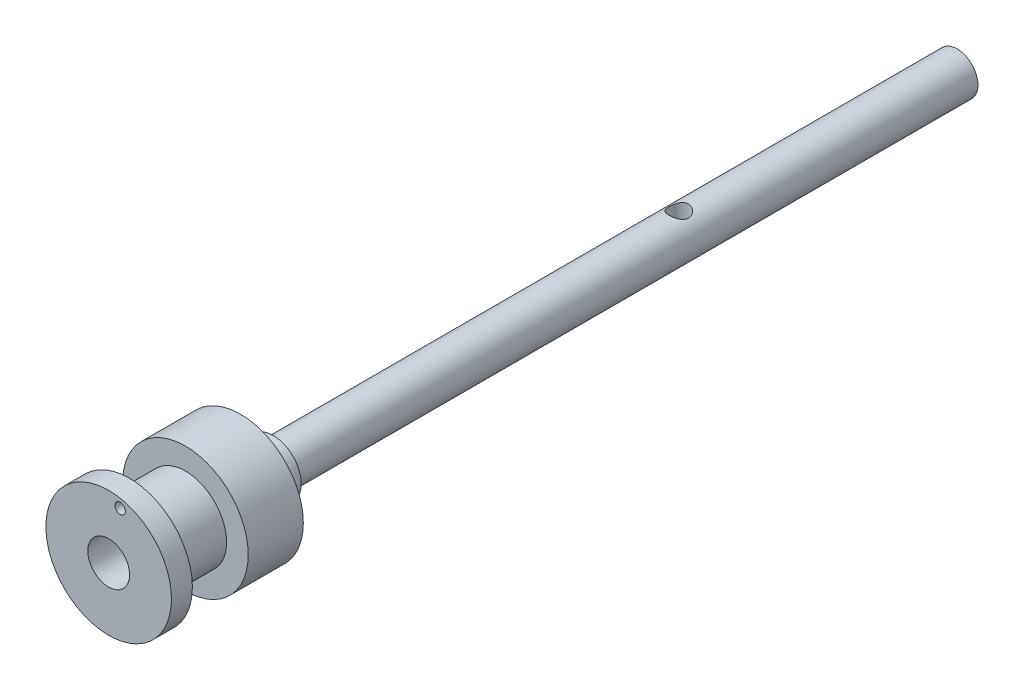
ISO-10303-21;
HEADER;
FILE_DESCRIPTION(('STEP AP214'),'2;1');
FILE_NAME('part.step','',(''),(''),'','','');
FILE_SCHEMA(('AUTOMOTIVE_DESIGN { 1 0 10303 214 1 1 1 1 }'));
ENDSEC;
DATA;
#1=APPLICATION_CONTEXT('core data for automotive mechanical design processes');
#2=APPLICATION_PROTOCOL_DEFINITION('international standard','automotive_design',2000,#1);
#3=PRODUCT_CONTEXT('',#1,'mechanical');
#4=PRODUCT('Part','Part','',(#3));
#5=PRODUCT_RELATED_PRODUCT_CATEGORY('part','',(#4));
#6=PRODUCT_DEFINITION_FORMATION('','',#4);
#7=PRODUCT_DEFINITION_CONTEXT('part definition',#1,'design');
#8=PRODUCT_DEFINITION('design','',#6,#7);
#9=PRODUCT_DEFINITION_SHAPE('','',#8);
#10=(LENGTH_UNIT() NAMED_UNIT(*) SI_UNIT(.MILLI.,.METRE.));
#11=(NAMED_UNIT(*) PLANE_ANGLE_UNIT() SI_UNIT($,.RADIAN.));
#12=(NAMED_UNIT(*) SI_UNIT($,.STERADIAN.) SOLID_ANGLE_UNIT());
#13=UNCERTAINTY_MEASURE_WITH_UNIT(LENGTH_MEASURE(1.E-05),#10,'distance_accuracy_value','');
#14=(GEOMETRIC_REPRESENTATION_CONTEXT(3) GLOBAL_UNCERTAINTY_ASSIGNED_CONTEXT((#13)) GLOBAL_UNIT_ASSIGNED_CONTEXT((#10,
#11,#12)) REPRESENTATION_CONTEXT('',''));
#15=CARTESIAN_POINT('',(0.,0.,0.));
#16=DIRECTION('',(0.,0.,1.));
#17=DIRECTION('',(1.,0.,0.));
#18=AXIS2_PLACEMENT_3D('',#15,#16,#17);
#19=CARTESIAN_POINT('',(0.,0.,98.));
#20=DIRECTION('',(0.,0.,-1.));
#21=DIRECTION('',(-1.,0.,0.));
#22=AXIS2_PLACEMENT_3D('',#19,#20,#21);
#23=CYLINDRICAL_SURFACE('',#22,3.);
#24=CARTESIAN_POINT('',(0.,-2.99999999999999,38.5));
#25=CARTESIAN_POINT('',(0.0741760141958586,-2.99999659855667,38.5000040505541));
#26=CARTESIAN_POINT('',(0.148457438343164,-2.99721866421498,38.5059298208353));
#27=CARTESIAN_POINT('',(0.294860958042646,-2.98638133101227,38.5293877592733));
#28=CARTESIAN_POINT('',(0.366977899485668,-2.97831023303417,38.546945637961));
#29=CARTESIAN_POINT('',(0.506705207958361,-2.95773878056305,38.5928517551339));
#30=CARTESIAN_POINT('',(0.574331184032734,-2.94525483671525,38.6211600432343));
#31=CARTESIAN_POINT('',(0.703790652559765,-2.91703179641225,38.6875743006987));
#32=CARTESIAN_POINT('',(0.765625113804216,-2.90129324579851,38.7256786273952));
#33=CARTESIAN_POINT('',(0.885556018232687,-2.86703510505486,38.8129906836775));
#34=CARTESIAN_POINT('',(0.943262854198603,-2.84841047078529,38.8626918392666));
#35=CARTESIAN_POINT('',(1.04987206669059,-2.81086626705385,38.9707341871541));
#36=CARTESIAN_POINT('',(1.09876864666267,-2.79194651225135,39.0290810220613));
#37=CARTESIAN_POINT('',(1.18954928643586,-2.75454886272565,39.1573436722992));
#38=CARTESIAN_POINT('',(1.23076801131512,-2.73618026181932,39.2277658265075));
#39=CARTESIAN_POINT('',(1.30060459631542,-2.70368671328043,39.3755083341662));
#40=CARTESIAN_POINT('',(1.32923050054669,-2.68955905843085,39.452824245907));
#41=CARTESIAN_POINT('',(1.37136389166293,-2.66831280778357,39.6077086691858));
#42=CARTESIAN_POINT('',(1.38562630954339,-2.66084688805231,39.685022013398));
#43=CARTESIAN_POINT('',(1.40096431780121,-2.65280653141493,39.8412761554687));
#44=CARTESIAN_POINT('',(1.40205018901381,-2.65222672171534,39.9202156363732));
#45=CARTESIAN_POINT('',(1.39156325474428,-2.6577381391041,40.0689521774073));
#46=CARTESIAN_POINT('',(1.381255487101,-2.66316277668237,40.1388686763252));
#47=CARTESIAN_POINT('',(1.35043639237287,-2.67892103840313,40.2758340783928));
#48=CARTESIAN_POINT('',(1.32992244300339,-2.68925592410991,40.3428822397673));
#49=CARTESIAN_POINT('',(1.27887161255287,-2.71390923378543,40.4740721913311));
#50=CARTESIAN_POINT('',(1.24811450695909,-2.7283140240837,40.5381113040015));
#51=CARTESIAN_POINT('',(1.17761205733664,-2.75947702819645,40.6604059963507));
#52=CARTESIAN_POINT('',(1.13786278548149,-2.77623626923161,40.7186590325906));
#53=CARTESIAN_POINT('',(1.04545769592097,-2.81242518177221,40.8343867427587));
#54=CARTESIAN_POINT('',(0.99186913562739,-2.83194722846672,40.8910901886705));
#55=CARTESIAN_POINT('',(0.875809338201009,-2.86996272516678,40.9950011611005));
#56=CARTESIAN_POINT('',(0.813334864133956,-2.88845579691006,41.0422052120085));
#57=CARTESIAN_POINT('',(0.678420066791921,-2.92314231667083,41.1273252580099));
#58=CARTESIAN_POINT('',(0.605704043903019,-2.9392303997136,41.1648505604658));
#59=CARTESIAN_POINT('',(0.454047875045114,-2.9664385628126,41.2268527185111));
#60=CARTESIAN_POINT('',(0.375112098848912,-2.97756209480586,41.2513386428982));
#61=CARTESIAN_POINT('',(0.219630179590069,-2.99289168727817,41.2847753854863));
#62=CARTESIAN_POINT('',(0.143350867486893,-2.99755511855446,41.2947561577534));
#63=CARTESIAN_POINT('',(-0.00993159603062295,-3.00096130674055,41.3020633399195));
#64=CARTESIAN_POINT('',(-0.0869344549310017,-2.99970636153703,41.2993946611306));
#65=CARTESIAN_POINT('',(-0.234138662301144,-2.99169876992405,41.2821402277437));
#66=CARTESIAN_POINT('',(-0.304455247280261,-2.98531143610107,41.268346120726));
#67=CARTESIAN_POINT('',(-0.441661374952197,-2.9681169868393,41.2304147035299));
#68=CARTESIAN_POINT('',(-0.508550515457682,-2.95730935403884,41.2062761826025));
#69=CARTESIAN_POINT('',(-0.63934631057296,-2.93186182190092,41.1476106001117));
#70=CARTESIAN_POINT('',(-0.70309874977937,-2.91711463217098,41.1127878500144));
#71=CARTESIAN_POINT('',(-0.82408133642419,-2.88527461622476,41.034065572947));
#72=CARTESIAN_POINT('',(-0.881308600637795,-2.86818076040266,40.9901620574598));
#73=CARTESIAN_POINT('',(-0.992927203863409,-2.83157928041133,40.8900494219181));
#74=CARTESIAN_POINT('',(-1.04662821994276,-2.81199150907127,40.8330982533047));
#75=CARTESIAN_POINT('',(-1.14397488618524,-2.7738171204936,40.710822052853));
#76=CARTESIAN_POINT('',(-1.18761573536873,-2.7552309844915,40.6454930459361));
#77=CARTESIAN_POINT('',(-1.26487258942864,-2.72065279755534,40.5055462612367));
#78=CARTESIAN_POINT('',(-1.29811762077689,-2.70476441122083,40.4306959670314));
#79=CARTESIAN_POINT('',(-1.35119476914698,-2.67864935946574,40.2754739377038));
#80=CARTESIAN_POINT('',(-1.37104172650418,-2.6684164320798,40.1951084206029));
#81=CARTESIAN_POINT('',(-1.39512361569358,-2.65589863089785,40.0389244522856));
#82=CARTESIAN_POINT('',(-1.40060458275625,-2.65298045006346,39.9633491392689));
#83=CARTESIAN_POINT('',(-1.39928993042138,-2.65367487263324,39.81234617673));
#84=CARTESIAN_POINT('',(-1.39249775922279,-2.65728564169682,39.7369184916911));
#85=CARTESIAN_POINT('',(-1.36795238910771,-2.66999487603889,39.5940999375163));
#86=CARTESIAN_POINT('',(-1.35103435582631,-2.67867409395688,39.5265240407042));
#87=CARTESIAN_POINT('',(-1.30765598987226,-2.70011439829818,39.3952017153972));
#88=CARTESIAN_POINT('',(-1.28119281477062,-2.71287670048705,39.3314564342173));
#89=CARTESIAN_POINT('',(-1.21748406199401,-2.74208602331761,39.2049634549476));
#90=CARTESIAN_POINT('',(-1.17964038065009,-2.7587211195529,39.1425615223786));
#91=CARTESIAN_POINT('',(-1.0949742620724,-2.79340714138716,39.0246101855588));
#92=CARTESIAN_POINT('',(-1.04814763276813,-2.81145872568486,38.9690640006461));
#93=CARTESIAN_POINT('',(-0.941307680520023,-2.84911508911861,38.8606263800043));
#94=CARTESIAN_POINT('',(-0.880442612871025,-2.86869394428718,38.8085607412822));
#95=CARTESIAN_POINT('',(-0.750199086477072,-2.90547332461736,38.7152565671488));
#96=CARTESIAN_POINT('',(-0.680816600685449,-2.92267271652822,38.6740231823952));
#97=CARTESIAN_POINT('',(-0.535611024288782,-2.95272548252542,38.6040125020167));
#98=CARTESIAN_POINT('',(-0.459824309977936,-2.96560157678301,38.5751698583364));
#99=CARTESIAN_POINT('',(-0.303822742627244,-2.98560363061671,38.5309772564507));
#100=CARTESIAN_POINT('',(-0.223621832238211,-2.99274669700571,38.5155871448256));
#101=CARTESIAN_POINT('',(-0.118989792805172,-2.99773444736987,38.5048609854243));
#102=CARTESIAN_POINT('',(-0.0952397688918287,-2.99858232619917,38.5030400999808));
#103=CARTESIAN_POINT('',(-0.0476634596251007,-2.99971565466793,38.50060894435));
#104=CARTESIAN_POINT('',(-0.0238371727597251,-3.00000109308638,38.4999986983156));
#105=CARTESIAN_POINT('',(0.,-2.99999999999999,38.5));
#106=B_SPLINE_CURVE_WITH_KNOTS('',3,(#24,#25,#26,#27,#28,#29,#30,#31,#32,#33,#34,#35,#36,#37,
#38,#39,#40,#41,#42,#43,#44,#45,#46,#47,#48,#49,#50,#51,#52,#53,#54,#55,#56,#57,#58,#59,#60,#61,
#62,#63,#64,#65,#66,#67,#68,#69,#70,#71,#72,#73,#74,#75,#76,#77,#78,#79,#80,#81,#82,#83,#84,#85,
#86,#87,#88,#89,#90,#91,#92,#93,#94,#95,#96,#97,#98,#99,#100,#101,#102,#103,#104,#105),
.UNSPECIFIED.,.T.,.F.,(4,2,2,2,2,2,2,2,2,2,2,2,2,2,2,2,2,2,2,2,2,2,2,2,2,2,2,2,2,2,2,2,2,2,2,2,
2,2,2,2,4),(0.,0.222430614227103,0.445354516020347,0.6674579744595,0.889524213319485,
1.12374008349084,1.35810949364731,1.60776429290694,1.85725938392491,2.0928231469925,
2.32820310256045,2.53985531348055,2.75156193252274,2.96815060600378,3.18483406988204,
3.42504393482462,3.66534152788205,3.91419776760518,4.16288070273415,4.39285884216799,
4.62274769694934,4.83758576938904,5.05244899415581,5.27389671638204,5.49544191175846,
5.73644174754948,5.97755635787824,6.2264897623231,6.47514698203737,6.7013896585824,
6.92756878101077,7.13725924988262,7.34701221368888,7.57065894835864,7.79441030722339,
8.04061569917069,8.28693794895592,8.53194466707523,8.77621756163928,8.84769634435318,
8.91917655309538),.UNSPECIFIED.);
#107=CARTESIAN_POINT('',(0.,-2.99999999999999,38.5));
#108=VERTEX_POINT('',#107);
#109=EDGE_CURVE('E52',#108,#108,#106,.T.);
#110=ORIENTED_EDGE('',*,*,#109,.F.);
#111=EDGE_LOOP('',(#110));
#112=FACE_BOUND('',#111,.T.);
#113=CARTESIAN_POINT('',(0.,0.,98.));
#114=DIRECTION('',(0.,0.,1.));
#115=DIRECTION('',(1.,0.,0.));
#116=AXIS2_PLACEMENT_3D('',#113,#114,#115);
#117=CIRCLE('',#116,3.);
#118=CARTESIAN_POINT('',(3.,0.,98.));
#119=VERTEX_POINT('',#118);
#120=EDGE_CURVE('E10',#119,#119,#117,.T.);
#121=ORIENTED_EDGE('',*,*,#120,.F.);
#122=EDGE_LOOP('',(#121));
#123=FACE_BOUND('',#122,.T.);
#124=CARTESIAN_POINT('',(0.,0.,0.));
#125=DIRECTION('',(0.,0.,1.));
#126=DIRECTION('',(1.,0.,0.));
#127=AXIS2_PLACEMENT_3D('',#124,#125,#126);
#128=CIRCLE('',#127,3.);
#129=CARTESIAN_POINT('',(3.,0.,0.));
#130=VERTEX_POINT('',#129);
#131=EDGE_CURVE('E42',#130,#130,#128,.T.);
#132=ORIENTED_EDGE('',*,*,#131,.T.);
#133=EDGE_LOOP('',(#132));
#134=FACE_BOUND('',#133,.T.);
#135=CARTESIAN_POINT('',(0.,3.00000000000001,38.5));
#136=CARTESIAN_POINT('',(-0.0741760141958469,2.99999659855672,38.5000040505541));
#137=CARTESIAN_POINT('',(-0.148457438343151,2.99721866421499,38.5059298208353));
#138=CARTESIAN_POINT('',(-0.29486095804263,2.98638133101226,38.5293877592733));
#139=CARTESIAN_POINT('',(-0.366977899485652,2.97831023303417,38.546945637961));
#140=CARTESIAN_POINT('',(-0.506705207958344,2.95773878056306,38.5928517551339));
#141=CARTESIAN_POINT('',(-0.574331184032714,2.94525483671525,38.6211600432343));
#142=CARTESIAN_POINT('',(-0.703790652559743,2.91703179641225,38.6875743006987));
#143=CARTESIAN_POINT('',(-0.765625113804195,2.90129324579851,38.7256786273952));
#144=CARTESIAN_POINT('',(-0.885556018232667,2.86703510505487,38.8129906836775));
#145=CARTESIAN_POINT('',(-0.943262854198583,2.8484104707853,38.8626918392666));
#146=CARTESIAN_POINT('',(-1.04987206669057,2.81086626705386,38.9707341871541));
#147=CARTESIAN_POINT('',(-1.09876864666265,2.79194651225135,39.0290810220613));
#148=CARTESIAN_POINT('',(-1.18954928643584,2.75454886272566,39.1573436722992));
#149=CARTESIAN_POINT('',(-1.2307680113151,2.73618026181933,39.2277658265075));
#150=CARTESIAN_POINT('',(-1.30060459631541,2.70368671328044,39.3755083341662));
#151=CARTESIAN_POINT('',(-1.32923050054667,2.68955905843086,39.452824245907));
#152=CARTESIAN_POINT('',(-1.37136389166291,2.66831280778357,39.6077086691858));
#153=CARTESIAN_POINT('',(-1.38562630954337,2.66084688805232,39.6850220133979));
#154=CARTESIAN_POINT('',(-1.4009643178012,2.65280653141493,39.8412761554687));
#155=CARTESIAN_POINT('',(-1.4020501890138,2.65222672171534,39.9202156363732));
#156=CARTESIAN_POINT('',(-1.39156325474427,2.6577381391041,40.0689521774073));
#157=CARTESIAN_POINT('',(-1.38125548710099,2.66316277668237,40.1388686763252));
#158=CARTESIAN_POINT('',(-1.35043639237286,2.67892103840314,40.2758340783928));
#159=CARTESIAN_POINT('',(-1.32992244300339,2.68925592410991,40.3428822397673));
#160=CARTESIAN_POINT('',(-1.27887161255287,2.71390923378543,40.4740721913311));
#161=CARTESIAN_POINT('',(-1.24811450695908,2.7283140240837,40.5381113040015));
#162=CARTESIAN_POINT('',(-1.17761205733663,2.75947702819645,40.6604059963507));
#163=CARTESIAN_POINT('',(-1.13786278548148,2.77623626923161,40.7186590325906));
#164=CARTESIAN_POINT('',(-1.04545769592096,2.81242518177222,40.8343867427587));
#165=CARTESIAN_POINT('',(-0.991869135627378,2.83194722846672,40.8910901886705));
#166=CARTESIAN_POINT('',(-0.875809338200994,2.86996272516678,40.9950011611005));
#167=CARTESIAN_POINT('',(-0.81333486413394,2.88845579691007,41.0422052120085));
#168=CARTESIAN_POINT('',(-0.678420066791903,2.92314231667084,41.1273252580099));
#169=CARTESIAN_POINT('',(-0.605704043903002,2.93923039971361,41.1648505604658));
#170=CARTESIAN_POINT('',(-0.454047875045097,2.9664385628126,41.2268527185111));
#171=CARTESIAN_POINT('',(-0.375112098848896,2.97756209480586,41.2513386428982));
#172=CARTESIAN_POINT('',(-0.219630179590055,2.99289168727817,41.2847753854863));
#173=CARTESIAN_POINT('',(-0.143350867486881,2.99755511855446,41.2947561577534));
#174=CARTESIAN_POINT('',(0.00993159603063199,3.00096130674055,41.3020633399195));
#175=CARTESIAN_POINT('',(0.0869344549310094,2.99970636153703,41.2993946611306));
#176=CARTESIAN_POINT('',(0.234138662301149,2.99169876992405,41.2821402277437));
#177=CARTESIAN_POINT('',(0.304455247280265,2.98531143610107,41.268346120726));
#178=CARTESIAN_POINT('',(0.441661374952199,2.9681169868393,41.2304147035299));
#179=CARTESIAN_POINT('',(0.508550515457684,2.95730935403884,41.2062761826025));
#180=CARTESIAN_POINT('',(0.639346310572959,2.93186182190092,41.1476106001117));
#181=CARTESIAN_POINT('',(0.703098749779367,2.91711463217098,41.1127878500144));
#182=CARTESIAN_POINT('',(0.824081336424185,2.88527461622476,41.034065572947));
#183=CARTESIAN_POINT('',(0.881308600637789,2.86818076040266,40.9901620574598));
#184=CARTESIAN_POINT('',(0.992927203863404,2.83157928041133,40.8900494219181));
#185=CARTESIAN_POINT('',(1.04662821994276,2.81199150907127,40.8330982533047));
#186=CARTESIAN_POINT('',(1.14397488618524,2.7738171204936,40.7108220528531));
#187=CARTESIAN_POINT('',(1.18761573536872,2.7552309844915,40.6454930459362));
#188=CARTESIAN_POINT('',(1.26487258942863,2.72065279755534,40.5055462612367));
#189=CARTESIAN_POINT('',(1.29811762077689,2.70476441122083,40.4306959670314));
#190=CARTESIAN_POINT('',(1.35119476914698,2.67864935946574,40.2754739377038));
#191=CARTESIAN_POINT('',(1.37104172650419,2.6684164320798,40.195108420603));
#192=CARTESIAN_POINT('',(1.39512361569359,2.65589863089785,40.0389244522856));
#193=CARTESIAN_POINT('',(1.40060458275626,2.65298045006346,39.9633491392689));
#194=CARTESIAN_POINT('',(1.39928993042139,2.65367487263323,39.81234617673));
#195=CARTESIAN_POINT('',(1.3924977592228,2.65728564169681,39.7369184916911));
#196=CARTESIAN_POINT('',(1.36795238910772,2.66999487603889,39.5940999375163));
#197=CARTESIAN_POINT('',(1.35103435582632,2.67867409395688,39.5265240407042));
#198=CARTESIAN_POINT('',(1.30765598987227,2.70011439829818,39.3952017153972));
#199=CARTESIAN_POINT('',(1.28119281477063,2.71287670048704,39.3314564342173));
#200=CARTESIAN_POINT('',(1.21748406199402,2.7420860233176,39.2049634549476));
#201=CARTESIAN_POINT('',(1.1796403806501,2.75872111955289,39.1425615223786));
#202=CARTESIAN_POINT('',(1.09497426207241,2.79340714138716,39.0246101855588));
#203=CARTESIAN_POINT('',(1.04814763276814,2.81145872568485,38.9690640006461));
#204=CARTESIAN_POINT('',(0.941307680520035,2.8491150891186,38.8606263800043));
#205=CARTESIAN_POINT('',(0.880442612871037,2.86869394428718,38.8085607412822));
#206=CARTESIAN_POINT('',(0.750199086477081,2.90547332461736,38.7152565671488));
#207=CARTESIAN_POINT('',(0.680816600685458,2.92267271652822,38.6740231823952));
#208=CARTESIAN_POINT('',(0.535611024288789,2.95272548252542,38.6040125020167));
#209=CARTESIAN_POINT('',(0.459824309977943,2.965601576783,38.5751698583364));
#210=CARTESIAN_POINT('',(0.30382274262725,2.98560363061672,38.5309772564507));
#211=CARTESIAN_POINT('',(0.223621832238217,2.99274669700571,38.5155871448256));
#212=CARTESIAN_POINT('',(0.118989792805177,2.99773444736986,38.5048609854243));
#213=CARTESIAN_POINT('',(0.0952397688918338,2.99858232619917,38.5030400999808));
#214=CARTESIAN_POINT('',(0.0476634596251074,2.99971565466794,38.50060894435));
#215=CARTESIAN_POINT('',(0.0238371727597333,3.0000010930864,38.4999986983156));
#216=CARTESIAN_POINT('',(0.,3.00000000000001,38.5));
#217=B_SPLINE_CURVE_WITH_KNOTS('',3,(#135,#136,#137,#138,#139,#140,#141,#142,#143,#144,#145,
#146,#147,#148,#149,#150,#151,#152,#153,#154,#155,#156,#157,#158,#159,#160,#161,#162,#163,#164,
#165,#166,#167,#168,#169,#170,#171,#172,#173,#174,#175,#176,#177,#178,#179,#180,#181,#182,#183,
#184,#185,#186,#187,#188,#189,#190,#191,#192,#193,#194,#195,#196,#197,#198,#199,#200,#201,#202,
#203,#204,#205,#206,#207,#208,#209,#210,#211,#212,#213,#214,#215,#216),.UNSPECIFIED.,.T.,.F.,(4,
2,2,2,2,2,2,2,2,2,2,2,2,2,2,2,2,2,2,2,2,2,2,2,2,2,2,2,2,2,2,2,2,2,2,2,2,2,2,2,4),(0.,
0.222430614227098,0.44535451602034,0.667457974459487,0.889524213319473,1.12374008349083,
1.35810949364729,1.60776429290693,1.85725938392489,2.09282314699247,2.32820310256043,
2.53985531348055,2.75156193252273,2.96815060600376,3.18483406988204,3.42504393482462,
3.66534152788206,3.91419776760519,4.16288070273415,4.39285884216799,4.62274769694934,
4.83758576938904,5.0524489941558,5.27389671638202,5.49544191175844,5.73644174754946,
5.97755635787822,6.22648976232308,6.47514698203736,6.70138965858239,6.92756878101076,
7.13725924988262,7.34701221368888,7.57065894835864,7.79441030722338,8.04061569917069,
8.28693794895592,8.53194466707524,8.77621756163929,8.84769634435319,8.91917655309538),.UNSPECIFIED.);
#218=CARTESIAN_POINT('',(0.,3.00000000000001,38.5));
#219=VERTEX_POINT('',#218);
#220=EDGE_CURVE('E35',#219,#219,#217,.T.);
#221=ORIENTED_EDGE('',*,*,#220,.F.);
#222=EDGE_LOOP('',(#221));
#223=FACE_BOUND('',#222,.T.);
#224=ADVANCED_FACE('F31',(#112,#123,#134,#223),#23,.T.);
#225=CARTESIAN_POINT('',(0.,0.,110.6));
#226=DIRECTION('',(0.,0.,1.));
#227=DIRECTION('',(1.,0.,0.));
#228=AXIS2_PLACEMENT_3D('',#225,#226,#227);
#229=PLANE('',#228);
#230=CARTESIAN_POINT('',(0.,0.,110.6));
#231=DIRECTION('',(0.,0.,1.));
#232=DIRECTION('',(1.,0.,0.));
#233=AXIS2_PLACEMENT_3D('',#230,#231,#232);
#234=CIRCLE('',#233,9.);
#235=CARTESIAN_POINT('',(9.,0.,110.6));
#236=VERTEX_POINT('',#235);
#237=EDGE_CURVE('E135',#236,#236,#234,.T.);
#238=ORIENTED_EDGE('',*,*,#237,.T.);
#239=EDGE_LOOP('',(#238));
#240=FACE_BOUND('',#239,.T.);
#241=CARTESIAN_POINT('',(0.,0.,110.6));
#242=DIRECTION('',(0.,0.,1.));
#243=DIRECTION('',(1.,0.,0.));
#244=AXIS2_PLACEMENT_3D('',#241,#242,#243);
#245=CIRCLE('',#244,5.9);
#246=CARTESIAN_POINT('',(5.9,0.,110.6));
#247=VERTEX_POINT('',#246);
#248=EDGE_CURVE('E125',#247,#247,#245,.T.);
#249=ORIENTED_EDGE('',*,*,#248,.F.);
#250=EDGE_LOOP('',(#249));
#251=FACE_BOUND('',#250,.T.);
#252=ADVANCED_FACE('F83',(#240,#251),#229,.T.);
#253=CARTESIAN_POINT('',(0.,0.,0.));
#254=DIRECTION('',(0.,0.,1.));
#255=DIRECTION('',(1.,0.,0.));
#256=AXIS2_PLACEMENT_3D('',#253,#254,#255);
#257=PLANE('',#256);
#258=ORIENTED_EDGE('',*,*,#131,.F.);
#259=EDGE_LOOP('',(#258));
#260=FACE_BOUND('',#259,.T.);
#261=ADVANCED_FACE('F86',(#260),#257,.F.);
#262=CARTESIAN_POINT('',(0.,0.,98.));
#263=DIRECTION('',(0.,0.,1.));
#264=DIRECTION('',(1.,0.,0.));
#265=AXIS2_PLACEMENT_3D('',#262,#263,#264);
#266=PLANE('',#265);
#267=CARTESIAN_POINT('',(0.,0.,98.));
#268=DIRECTION('',(0.,0.,1.));
#269=DIRECTION('',(1.,0.,0.));
#270=AXIS2_PLACEMENT_3D('',#267,#268,#269);
#271=CIRCLE('',#270,4.);
#272=CARTESIAN_POINT('',(4.,0.,98.));
#273=VERTEX_POINT('',#272);
#274=EDGE_CURVE('E50',#273,#273,#271,.T.);
#275=ORIENTED_EDGE('',*,*,#274,.F.);
#276=EDGE_LOOP('',(#275));
#277=FACE_BOUND('',#276,.T.);
#278=ORIENTED_EDGE('',*,*,#120,.T.);
#279=EDGE_LOOP('',(#278));
#280=FACE_BOUND('',#279,.T.);
#281=ADVANCED_FACE('F96',(#277,#280),#266,.F.);
#282=CARTESIAN_POINT('',(0.,0.,102.7));
#283=DIRECTION('',(0.,0.,-1.));
#284=DIRECTION('',(-1.,0.,0.));
#285=AXIS2_PLACEMENT_3D('',#282,#283,#284);
#286=CYLINDRICAL_SURFACE('',#285,4.);
#287=CARTESIAN_POINT('',(0.,0.,102.7));
#288=DIRECTION('',(0.,0.,1.));
#289=DIRECTION('',(1.,0.,0.));
#290=AXIS2_PLACEMENT_3D('',#287,#288,#289);
#291=CIRCLE('',#290,4.);
#292=CARTESIAN_POINT('',(4.,0.,102.7));
#293=VERTEX_POINT('',#292);
#294=EDGE_CURVE('E47',#293,#293,#291,.T.);
#295=ORIENTED_EDGE('',*,*,#294,.F.);
#296=EDGE_LOOP('',(#295));
#297=FACE_BOUND('',#296,.T.);
#298=ORIENTED_EDGE('',*,*,#274,.T.);
#299=EDGE_LOOP('',(#298));
#300=FACE_BOUND('',#299,.T.);
#301=ADVANCED_FACE('F91',(#297,#300),#286,.T.);
#302=CARTESIAN_POINT('',(0.,0.,102.7));
#303=DIRECTION('',(0.,0.,1.));
#304=DIRECTION('',(1.,0.,0.));
#305=AXIS2_PLACEMENT_3D('',#302,#303,#304);
#306=PLANE('',#305);
#307=CARTESIAN_POINT('',(0.,0.,102.7));
#308=DIRECTION('',(0.,0.,1.));
#309=DIRECTION('',(1.,0.,0.));
#310=AXIS2_PLACEMENT_3D('',#307,#308,#309);
#311=CIRCLE('',#310,9.);
#312=CARTESIAN_POINT('',(9.,0.,102.7));
#313=VERTEX_POINT('',#312);
#314=EDGE_CURVE('E132',#313,#313,#311,.T.);
#315=ORIENTED_EDGE('',*,*,#314,.F.);
#316=EDGE_LOOP('',(#315));
#317=FACE_BOUND('',#316,.T.);
#318=ORIENTED_EDGE('',*,*,#294,.T.);
#319=EDGE_LOOP('',(#318));
#320=FACE_BOUND('',#319,.T.);
#321=ADVANCED_FACE('F88',(#317,#320),#306,.F.);
#322=CARTESIAN_POINT('',(0.,0.,110.6));
#323=DIRECTION('',(0.,0.,-1.));
#324=DIRECTION('',(-1.,0.,0.));
#325=AXIS2_PLACEMENT_3D('',#322,#323,#324);
#326=CYLINDRICAL_SURFACE('',#325,9.);
#327=ORIENTED_EDGE('',*,*,#237,.F.);
#328=EDGE_LOOP('',(#327));
#329=FACE_BOUND('',#328,.T.);
#330=ORIENTED_EDGE('',*,*,#314,.T.);
#331=EDGE_LOOP('',(#330));
#332=FACE_BOUND('',#331,.T.);
#333=ADVANCED_FACE('F81',(#329,#332),#326,.T.);
#334=CARTESIAN_POINT('',(0.,0.,118.6));
#335=DIRECTION('',(0.,0.,-1.));
#336=DIRECTION('',(-1.,0.,0.));
#337=AXIS2_PLACEMENT_3D('',#334,#335,#336);
#338=CYLINDRICAL_SURFACE('',#337,5.9);
#339=CARTESIAN_POINT('',(0.,0.,118.6));
#340=DIRECTION('',(0.,0.,1.));
#341=DIRECTION('',(1.,0.,0.));
#342=AXIS2_PLACEMENT_3D('',#339,#340,#341);
#343=CIRCLE('',#342,5.9);
#344=CARTESIAN_POINT('',(5.9,0.,118.6));
#345=VERTEX_POINT('',#344);
#346=EDGE_CURVE('E129',#345,#345,#343,.T.);
#347=ORIENTED_EDGE('',*,*,#346,.F.);
#348=EDGE_LOOP('',(#347));
#349=FACE_BOUND('',#348,.T.);
#350=ORIENTED_EDGE('',*,*,#248,.T.);
#351=EDGE_LOOP('',(#350));
#352=FACE_BOUND('',#351,.T.);
#353=ADVANCED_FACE('F74',(#349,#352),#338,.T.);
#354=CARTESIAN_POINT('',(0.,0.,118.6));
#355=DIRECTION('',(0.,0.,1.));
#356=DIRECTION('',(1.,0.,0.));
#357=AXIS2_PLACEMENT_3D('',#354,#355,#356);
#358=PLANE('',#357);
#359=CARTESIAN_POINT('',(1.63775133757756,7.5882478641098,118.6));
#360=DIRECTION('',(0.,0.,1.));
#361=DIRECTION('',(1.,0.,0.));
#362=AXIS2_PLACEMENT_3D('',#359,#360,#361);
#363=CIRCLE('',#362,0.75);
#364=CARTESIAN_POINT('',(2.38775133757756,7.5882478641098,118.6));
#365=VERTEX_POINT('',#364);
#366=EDGE_CURVE('E156',#365,#365,#363,.T.);
#367=ORIENTED_EDGE('',*,*,#366,.T.);
#368=EDGE_LOOP('',(#367));
#369=FACE_BOUND('',#368,.T.);
#370=CARTESIAN_POINT('',(0.,0.,118.6));
#371=DIRECTION('',(0.,0.,1.));
#372=DIRECTION('',(1.,0.,0.));
#373=AXIS2_PLACEMENT_3D('',#370,#371,#372);
#374=CIRCLE('',#373,9.);
#375=CARTESIAN_POINT('',(9.,0.,118.6));
#376=VERTEX_POINT('',#375);
#377=EDGE_CURVE('E118',#376,#376,#374,.T.);
#378=ORIENTED_EDGE('',*,*,#377,.F.);
#379=EDGE_LOOP('',(#378));
#380=FACE_BOUND('',#379,.T.);
#381=ORIENTED_EDGE('',*,*,#346,.T.);
#382=EDGE_LOOP('',(#381));
#383=FACE_BOUND('',#382,.T.);
#384=ADVANCED_FACE('F71',(#369,#380,#383),#358,.F.);
#385=CARTESIAN_POINT('',(0.,0.,121.6));
#386=DIRECTION('',(0.,0.,-1.));
#387=DIRECTION('',(-1.,0.,0.));
#388=AXIS2_PLACEMENT_3D('',#385,#386,#387);
#389=CYLINDRICAL_SURFACE('',#388,9.);
#390=CARTESIAN_POINT('',(0.,0.,121.6));
#391=DIRECTION('',(0.,0.,1.));
#392=DIRECTION('',(1.,0.,0.));
#393=AXIS2_PLACEMENT_3D('',#390,#391,#392);
#394=CIRCLE('',#393,9.);
#395=CARTESIAN_POINT('',(9.,0.,121.6));
#396=VERTEX_POINT('',#395);
#397=EDGE_CURVE('E120',#396,#396,#394,.T.);
#398=ORIENTED_EDGE('',*,*,#397,.F.);
#399=EDGE_LOOP('',(#398));
#400=FACE_BOUND('',#399,.T.);
#401=ORIENTED_EDGE('',*,*,#377,.T.);
#402=EDGE_LOOP('',(#401));
#403=FACE_BOUND('',#402,.T.);
#404=ADVANCED_FACE('F69',(#400,#403),#389,.T.);
#405=CARTESIAN_POINT('',(0.,0.,121.6));
#406=DIRECTION('',(0.,0.,1.));
#407=DIRECTION('',(1.,0.,0.));
#408=AXIS2_PLACEMENT_3D('',#405,#406,#407);
#409=PLANE('',#408);
#410=CARTESIAN_POINT('',(1.63775133757756,7.5882478641098,121.6));
#411=DIRECTION('',(0.,0.,1.));
#412=DIRECTION('',(1.,0.,0.));
#413=AXIS2_PLACEMENT_3D('',#410,#411,#412);
#414=CIRCLE('',#413,0.75);
#415=CARTESIAN_POINT('',(2.38775133757756,7.5882478641098,121.6));
#416=VERTEX_POINT('',#415);
#417=EDGE_CURVE('E161',#416,#416,#414,.T.);
#418=ORIENTED_EDGE('',*,*,#417,.F.);
#419=EDGE_LOOP('',(#418));
#420=FACE_BOUND('',#419,.T.);
#421=CARTESIAN_POINT('',(0.,0.,121.6));
#422=DIRECTION('',(0.,0.,1.));
#423=DIRECTION('',(1.,0.,0.));
#424=AXIS2_PLACEMENT_3D('',#421,#422,#423);
#425=CIRCLE('',#424,3.);
#426=CARTESIAN_POINT('',(3.,0.,121.6));
#427=VERTEX_POINT('',#426);
#428=EDGE_CURVE('E153',#427,#427,#425,.T.);
#429=ORIENTED_EDGE('',*,*,#428,.F.);
#430=EDGE_LOOP('',(#429));
#431=FACE_BOUND('',#430,.T.);
#432=ORIENTED_EDGE('',*,*,#397,.T.);
#433=EDGE_LOOP('',(#432));
#434=FACE_BOUND('',#433,.T.);
#435=ADVANCED_FACE('F63',(#420,#431,#434),#409,.T.);
#436=CARTESIAN_POINT('',(0.,82.,39.9));
#437=DIRECTION('',(0.,-1.,0.));
#438=DIRECTION('',(0.,0.,-1.));
#439=AXIS2_PLACEMENT_3D('',#436,#437,#438);
#440=CYLINDRICAL_SURFACE('',#439,1.4);
#441=ORIENTED_EDGE('',*,*,#109,.T.);
#442=EDGE_LOOP('',(#441));
#443=FACE_BOUND('',#442,.T.);
#444=ORIENTED_EDGE('',*,*,#220,.T.);
#445=EDGE_LOOP('',(#444));
#446=FACE_BOUND('',#445,.T.);
#447=ADVANCED_FACE('F57',(#443,#446),#440,.F.);
#448=CARTESIAN_POINT('',(0.,0.,112.6));
#449=DIRECTION('',(0.,0.,1.));
#450=DIRECTION('',(1.,0.,0.));
#451=AXIS2_PLACEMENT_3D('',#448,#449,#450);
#452=CYLINDRICAL_SURFACE('',#451,3.);
#453=CARTESIAN_POINT('',(0.,0.,112.6));
#454=DIRECTION('',(0.,0.,1.));
#455=DIRECTION('',(1.,0.,0.));
#456=AXIS2_PLACEMENT_3D('',#453,#454,#455);
#457=CIRCLE('',#456,3.);
#458=CARTESIAN_POINT('',(3.,0.,112.6));
#459=VERTEX_POINT('',#458);
#460=EDGE_CURVE('E56',#459,#459,#457,.T.);
#461=ORIENTED_EDGE('',*,*,#460,.F.);
#462=EDGE_LOOP('',(#461));
#463=FACE_BOUND('',#462,.T.);
#464=ORIENTED_EDGE('',*,*,#428,.T.);
#465=EDGE_LOOP('',(#464));
#466=FACE_BOUND('',#465,.T.);
#467=ADVANCED_FACE('F62',(#463,#466),#452,.F.);
#468=CARTESIAN_POINT('',(0.,0.,112.6));
#469=DIRECTION('',(0.,0.,1.));
#470=DIRECTION('',(1.,0.,0.));
#471=AXIS2_PLACEMENT_3D('',#468,#469,#470);
#472=PLANE('',#471);
#473=ORIENTED_EDGE('',*,*,#460,.T.);
#474=EDGE_LOOP('',(#473));
#475=FACE_BOUND('',#474,.T.);
#476=ADVANCED_FACE('F173',(#475),#472,.T.);
#477=CARTESIAN_POINT('',(1.63775133757756,7.5882478641098,112.6));
#478=DIRECTION('',(0.,0.,1.));
#479=DIRECTION('',(1.,0.,0.));
#480=AXIS2_PLACEMENT_3D('',#477,#478,#479);
#481=CYLINDRICAL_SURFACE('',#480,0.75);
#482=ORIENTED_EDGE('',*,*,#417,.T.);
#483=EDGE_LOOP('',(#482));
#484=FACE_BOUND('',#483,.T.);
#485=ORIENTED_EDGE('',*,*,#366,.F.);
#486=EDGE_LOOP('',(#485));
#487=FACE_BOUND('',#486,.T.);
#488=ADVANCED_FACE('F165',(#484,#487),#481,.F.);
#489=CLOSED_SHELL('',(#224,#252,#261,#281,#301,#321,#333,#353,#384,#404,#435,#447,#467,#476,#488));
#490=MANIFOLD_SOLID_BREP('B2',#489);
#491=ADVANCED_BREP_SHAPE_REPRESENTATION('',(#18,#490),#14);
#492=SHAPE_DEFINITION_REPRESENTATION(#9,#491);
ENDSEC;
END-ISO-10303-21;
